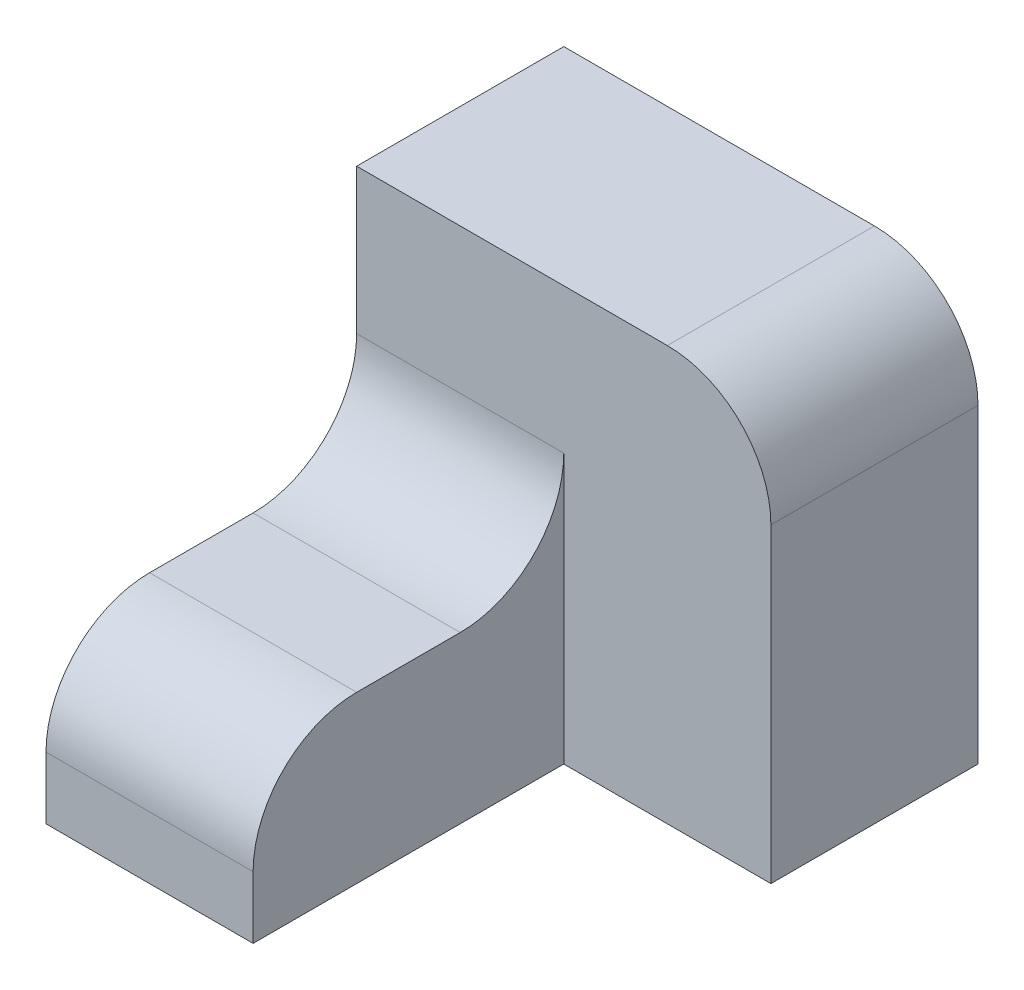
ISO-10303-21;
HEADER;
FILE_DESCRIPTION(('STEP AP214'),'2;1');
FILE_NAME('part.step','',(''),(''),'','','');
FILE_SCHEMA(('AUTOMOTIVE_DESIGN { 1 0 10303 214 1 1 1 1 }'));
ENDSEC;
DATA;
#1=APPLICATION_CONTEXT('core data for automotive mechanical design processes');
#2=APPLICATION_PROTOCOL_DEFINITION('international standard','automotive_design',2000,#1);
#3=PRODUCT_CONTEXT('',#1,'mechanical');
#4=PRODUCT('Part','Part','',(#3));
#5=PRODUCT_RELATED_PRODUCT_CATEGORY('part','',(#4));
#6=PRODUCT_DEFINITION_FORMATION('','',#4);
#7=PRODUCT_DEFINITION_CONTEXT('part definition',#1,'design');
#8=PRODUCT_DEFINITION('design','',#6,#7);
#9=PRODUCT_DEFINITION_SHAPE('','',#8);
#10=(LENGTH_UNIT() NAMED_UNIT(*) SI_UNIT(.MILLI.,.METRE.));
#11=(NAMED_UNIT(*) PLANE_ANGLE_UNIT() SI_UNIT($,.RADIAN.));
#12=(NAMED_UNIT(*) SI_UNIT($,.STERADIAN.) SOLID_ANGLE_UNIT());
#13=UNCERTAINTY_MEASURE_WITH_UNIT(LENGTH_MEASURE(1.E-05),#10,'distance_accuracy_value','');
#14=(GEOMETRIC_REPRESENTATION_CONTEXT(3) GLOBAL_UNCERTAINTY_ASSIGNED_CONTEXT((#13)) GLOBAL_UNIT_ASSIGNED_CONTEXT((#10,
#11,#12)) REPRESENTATION_CONTEXT('',''));
#15=CARTESIAN_POINT('',(0.,0.,0.));
#16=DIRECTION('',(0.,0.,1.));
#17=DIRECTION('',(1.,0.,0.));
#18=AXIS2_PLACEMENT_3D('',#15,#16,#17);
#19=CARTESIAN_POINT('',(-10.,0.,30.));
#20=DIRECTION('',(0.,-1.,0.));
#21=DIRECTION('',(1.,0.,0.));
#22=AXIS2_PLACEMENT_3D('',#19,#20,#21);
#23=PLANE('',#22);
#24=DIRECTION('',(0.,0.,-1.));
#25=VECTOR('',#24,1.);
#26=CARTESIAN_POINT('',(-10.,0.,30.));
#27=LINE('',#26,#25);
#28=CARTESIAN_POINT('',(-10.,0.,20.));
#29=VERTEX_POINT('',#28);
#30=CARTESIAN_POINT('',(-10.,0.,10.));
#31=VERTEX_POINT('',#30);
#32=EDGE_CURVE('E164',#29,#31,#27,.T.);
#33=ORIENTED_EDGE('',*,*,#32,.T.);
#34=DIRECTION('',(-1.,0.,0.));
#35=VECTOR('',#34,1.);
#36=CARTESIAN_POINT('',(-10.,0.,10.));
#37=LINE('',#36,#35);
#38=CARTESIAN_POINT('',(-30.,0.,10.));
#39=VERTEX_POINT('',#38);
#40=EDGE_CURVE('E178',#31,#39,#37,.T.);
#41=ORIENTED_EDGE('',*,*,#40,.T.);
#42=DIRECTION('',(0.,0.,-1.));
#43=VECTOR('',#42,1.);
#44=CARTESIAN_POINT('',(-30.,0.,30.));
#45=LINE('',#44,#43);
#46=CARTESIAN_POINT('',(-30.,0.,20.));
#47=VERTEX_POINT('',#46);
#48=EDGE_CURVE('E173',#47,#39,#45,.T.);
#49=ORIENTED_EDGE('',*,*,#48,.F.);
#50=DIRECTION('',(-1.,0.,0.));
#51=VECTOR('',#50,1.);
#52=CARTESIAN_POINT('',(-10.,0.,20.));
#53=LINE('',#52,#51);
#54=EDGE_CURVE('E176',#47,#29,#53,.F.);
#55=ORIENTED_EDGE('',*,*,#54,.T.);
#56=EDGE_LOOP('',(#33,#41,#49,#55));
#57=FACE_BOUND('',#56,.T.);
#58=ADVANCED_FACE('F35',(#57),#23,.F.);
#59=CARTESIAN_POINT('',(-30.,0.,30.));
#60=DIRECTION('',(1.,0.,0.));
#61=DIRECTION('',(0.,0.,-1.));
#62=AXIS2_PLACEMENT_3D('',#59,#60,#61);
#63=PLANE('',#62);
#64=DIRECTION('',(0.,-1.,0.));
#65=VECTOR('',#64,1.);
#66=CARTESIAN_POINT('',(-30.,0.,30.));
#67=LINE('',#66,#65);
#68=CARTESIAN_POINT('',(-30.,-10.,30.));
#69=VERTEX_POINT('',#68);
#70=CARTESIAN_POINT('',(-30.,-16.,30.));
#71=VERTEX_POINT('',#70);
#72=EDGE_CURVE('E158',#69,#71,#67,.T.);
#73=ORIENTED_EDGE('',*,*,#72,.F.);
#74=CARTESIAN_POINT('',(-30.,-10.,20.));
#75=DIRECTION('',(1.,0.,0.));
#76=DIRECTION('',(0.,0.,-1.));
#77=AXIS2_PLACEMENT_3D('',#74,#75,#76);
#78=CIRCLE('',#77,10.);
#79=EDGE_CURVE('E58',#69,#47,#78,.F.);
#80=ORIENTED_EDGE('',*,*,#79,.T.);
#81=ORIENTED_EDGE('',*,*,#48,.T.);
#82=CARTESIAN_POINT('',(-30.,10.,10.));
#83=DIRECTION('',(1.,0.,0.));
#84=DIRECTION('',(0.,0.,-1.));
#85=AXIS2_PLACEMENT_3D('',#82,#83,#84);
#86=CIRCLE('',#85,10.);
#87=CARTESIAN_POINT('',(-30.,10.,0.));
#88=VERTEX_POINT('',#87);
#89=EDGE_CURVE('E43',#39,#88,#86,.T.);
#90=ORIENTED_EDGE('',*,*,#89,.T.);
#91=DIRECTION('',(0.,-1.,0.));
#92=VECTOR('',#91,1.);
#93=CARTESIAN_POINT('',(-30.,24.,0.));
#94=LINE('',#93,#92);
#95=CARTESIAN_POINT('',(-30.,24.,0.));
#96=VERTEX_POINT('',#95);
#97=EDGE_CURVE('E134',#96,#88,#94,.T.);
#98=ORIENTED_EDGE('',*,*,#97,.F.);
#99=DIRECTION('',(0.,0.,1.));
#100=VECTOR('',#99,1.);
#101=CARTESIAN_POINT('',(-30.,24.,-20.));
#102=LINE('',#101,#100);
#103=CARTESIAN_POINT('',(-30.,24.,-20.));
#104=VERTEX_POINT('',#103);
#105=EDGE_CURVE('E118',#104,#96,#102,.T.);
#106=ORIENTED_EDGE('',*,*,#105,.F.);
#107=DIRECTION('',(0.,-1.,0.));
#108=VECTOR('',#107,1.);
#109=CARTESIAN_POINT('',(-30.,24.,-20.));
#110=LINE('',#109,#108);
#111=CARTESIAN_POINT('',(-30.,-16.,-20.));
#112=VERTEX_POINT('',#111);
#113=EDGE_CURVE('E125',#104,#112,#110,.T.);
#114=ORIENTED_EDGE('',*,*,#113,.T.);
#115=DIRECTION('',(0.,0.,-1.));
#116=VECTOR('',#115,1.);
#117=CARTESIAN_POINT('',(-30.,-16.,30.));
#118=LINE('',#117,#116);
#119=EDGE_CURVE('E171',#71,#112,#118,.T.);
#120=ORIENTED_EDGE('',*,*,#119,.F.);
#121=EDGE_LOOP('',(#73,#80,#81,#90,#98,#106,#114,#120));
#122=FACE_BOUND('',#121,.T.);
#123=ADVANCED_FACE('F131',(#122),#63,.F.);
#124=CARTESIAN_POINT('',(-30.,-16.,30.));
#125=DIRECTION('',(0.,1.,0.));
#126=DIRECTION('',(0.,0.,1.));
#127=AXIS2_PLACEMENT_3D('',#124,#125,#126);
#128=PLANE('',#127);
#129=ORIENTED_EDGE('',*,*,#119,.T.);
#130=DIRECTION('',(1.,0.,0.));
#131=VECTOR('',#130,1.);
#132=CARTESIAN_POINT('',(-30.,-16.,-20.));
#133=LINE('',#132,#131);
#134=CARTESIAN_POINT('',(10.,-16.,-20.));
#135=VERTEX_POINT('',#134);
#136=EDGE_CURVE('E142',#112,#135,#133,.T.);
#137=ORIENTED_EDGE('',*,*,#136,.T.);
#138=DIRECTION('',(0.,0.,1.));
#139=VECTOR('',#138,1.);
#140=CARTESIAN_POINT('',(10.,-16.,-20.));
#141=LINE('',#140,#139);
#142=CARTESIAN_POINT('',(10.,-16.,0.));
#143=VERTEX_POINT('',#142);
#144=EDGE_CURVE('E135',#135,#143,#141,.T.);
#145=ORIENTED_EDGE('',*,*,#144,.T.);
#146=DIRECTION('',(1.,0.,0.));
#147=VECTOR('',#146,1.);
#148=CARTESIAN_POINT('',(-30.,-16.,0.));
#149=LINE('',#148,#147);
#150=CARTESIAN_POINT('',(-10.,-16.,0.));
#151=VERTEX_POINT('',#150);
#152=EDGE_CURVE('E151',#151,#143,#149,.T.);
#153=ORIENTED_EDGE('',*,*,#152,.F.);
#154=DIRECTION('',(0.,0.,-1.));
#155=VECTOR('',#154,1.);
#156=CARTESIAN_POINT('',(-10.,-16.,30.));
#157=LINE('',#156,#155);
#158=CARTESIAN_POINT('',(-10.,-16.,30.));
#159=VERTEX_POINT('',#158);
#160=EDGE_CURVE('E168',#159,#151,#157,.T.);
#161=ORIENTED_EDGE('',*,*,#160,.F.);
#162=DIRECTION('',(1.,0.,0.));
#163=VECTOR('',#162,1.);
#164=CARTESIAN_POINT('',(-30.,-16.,30.));
#165=LINE('',#164,#163);
#166=EDGE_CURVE('E160',#71,#159,#165,.T.);
#167=ORIENTED_EDGE('',*,*,#166,.F.);
#168=EDGE_LOOP('',(#129,#137,#145,#153,#161,#167));
#169=FACE_BOUND('',#168,.T.);
#170=ADVANCED_FACE('F210',(#169),#128,.F.);
#171=CARTESIAN_POINT('',(-10.,-16.,30.));
#172=DIRECTION('',(-1.,0.,0.));
#173=DIRECTION('',(0.,0.,1.));
#174=AXIS2_PLACEMENT_3D('',#171,#172,#173);
#175=PLANE('',#174);
#176=ORIENTED_EDGE('',*,*,#32,.F.);
#177=CARTESIAN_POINT('',(-10.,-10.,20.));
#178=DIRECTION('',(-1.,0.,0.));
#179=DIRECTION('',(0.,0.,1.));
#180=AXIS2_PLACEMENT_3D('',#177,#178,#179);
#181=CIRCLE('',#180,10.);
#182=CARTESIAN_POINT('',(-10.,-10.,30.));
#183=VERTEX_POINT('',#182);
#184=EDGE_CURVE('E50',#29,#183,#181,.F.);
#185=ORIENTED_EDGE('',*,*,#184,.T.);
#186=DIRECTION('',(0.,1.,0.));
#187=VECTOR('',#186,1.);
#188=CARTESIAN_POINT('',(-10.,-16.,30.));
#189=LINE('',#188,#187);
#190=EDGE_CURVE('E162',#159,#183,#189,.T.);
#191=ORIENTED_EDGE('',*,*,#190,.F.);
#192=ORIENTED_EDGE('',*,*,#160,.T.);
#193=DIRECTION('',(0.,1.,0.));
#194=VECTOR('',#193,1.);
#195=CARTESIAN_POINT('',(-10.,-16.,0.));
#196=LINE('',#195,#194);
#197=CARTESIAN_POINT('',(-10.,10.,0.));
#198=VERTEX_POINT('',#197);
#199=EDGE_CURVE('E156',#151,#198,#196,.T.);
#200=ORIENTED_EDGE('',*,*,#199,.T.);
#201=CARTESIAN_POINT('',(-10.,10.,10.));
#202=DIRECTION('',(-1.,0.,0.));
#203=DIRECTION('',(0.,0.,1.));
#204=AXIS2_PLACEMENT_3D('',#201,#202,#203);
#205=CIRCLE('',#204,10.);
#206=EDGE_CURVE('E11',#198,#31,#205,.T.);
#207=ORIENTED_EDGE('',*,*,#206,.T.);
#208=EDGE_LOOP('',(#176,#185,#191,#192,#200,#207));
#209=FACE_BOUND('',#208,.T.);
#210=ADVANCED_FACE('F203',(#209),#175,.F.);
#211=CARTESIAN_POINT('',(0.,0.,30.));
#212=DIRECTION('',(0.,0.,1.));
#213=DIRECTION('',(1.,0.,0.));
#214=AXIS2_PLACEMENT_3D('',#211,#212,#213);
#215=PLANE('',#214);
#216=ORIENTED_EDGE('',*,*,#190,.T.);
#217=DIRECTION('',(-1.,0.,0.));
#218=VECTOR('',#217,1.);
#219=CARTESIAN_POINT('',(-30.,-10.,30.));
#220=LINE('',#219,#218);
#221=EDGE_CURVE('E192',#183,#69,#220,.T.);
#222=ORIENTED_EDGE('',*,*,#221,.T.);
#223=ORIENTED_EDGE('',*,*,#72,.T.);
#224=ORIENTED_EDGE('',*,*,#166,.T.);
#225=EDGE_LOOP('',(#216,#222,#223,#224));
#226=FACE_BOUND('',#225,.T.);
#227=ADVANCED_FACE('F206',(#226),#215,.T.);
#228=CARTESIAN_POINT('',(0.,0.,0.));
#229=DIRECTION('',(0.,0.,1.));
#230=DIRECTION('',(1.,0.,0.));
#231=AXIS2_PLACEMENT_3D('',#228,#229,#230);
#232=PLANE('',#231);
#233=ORIENTED_EDGE('',*,*,#97,.T.);
#234=DIRECTION('',(-1.,0.,0.));
#235=VECTOR('',#234,1.);
#236=CARTESIAN_POINT('',(0.,10.,0.));
#237=LINE('',#236,#235);
#238=EDGE_CURVE('E183',#88,#198,#237,.F.);
#239=ORIENTED_EDGE('',*,*,#238,.T.);
#240=ORIENTED_EDGE('',*,*,#199,.F.);
#241=ORIENTED_EDGE('',*,*,#152,.T.);
#242=DIRECTION('',(0.,1.,0.));
#243=VECTOR('',#242,1.);
#244=CARTESIAN_POINT('',(10.,-16.,0.));
#245=LINE('',#244,#243);
#246=CARTESIAN_POINT('',(10.,14.,0.));
#247=VERTEX_POINT('',#246);
#248=EDGE_CURVE('E126',#143,#247,#245,.T.);
#249=ORIENTED_EDGE('',*,*,#248,.T.);
#250=CARTESIAN_POINT('',(0.,14.,0.));
#251=DIRECTION('',(0.,0.,1.));
#252=DIRECTION('',(1.,0.,0.));
#253=AXIS2_PLACEMENT_3D('',#250,#251,#252);
#254=CIRCLE('',#253,10.);
#255=CARTESIAN_POINT('',(0.,24.,0.));
#256=VERTEX_POINT('',#255);
#257=EDGE_CURVE('E181',#247,#256,#254,.T.);
#258=ORIENTED_EDGE('',*,*,#257,.T.);
#259=DIRECTION('',(-1.,0.,0.));
#260=VECTOR('',#259,1.);
#261=CARTESIAN_POINT('',(10.,24.,0.));
#262=LINE('',#261,#260);
#263=EDGE_CURVE('E148',#256,#96,#262,.T.);
#264=ORIENTED_EDGE('',*,*,#263,.T.);
#265=EDGE_LOOP('',(#233,#239,#240,#241,#249,#258,#264));
#266=FACE_BOUND('',#265,.T.);
#267=ADVANCED_FACE('F200',(#266),#232,.T.);
#268=CARTESIAN_POINT('',(10.,24.,-20.));
#269=DIRECTION('',(0.,1.,0.));
#270=DIRECTION('',(0.,0.,1.));
#271=AXIS2_PLACEMENT_3D('',#268,#269,#270);
#272=PLANE('',#271);
#273=ORIENTED_EDGE('',*,*,#263,.F.);
#274=DIRECTION('',(0.,0.,1.));
#275=VECTOR('',#274,1.);
#276=CARTESIAN_POINT('',(0.,24.,-20.));
#277=LINE('',#276,#275);
#278=CARTESIAN_POINT('',(0.,24.,-20.));
#279=VERTEX_POINT('',#278);
#280=EDGE_CURVE('E121',#256,#279,#277,.F.);
#281=ORIENTED_EDGE('',*,*,#280,.T.);
#282=DIRECTION('',(-1.,0.,0.));
#283=VECTOR('',#282,1.);
#284=CARTESIAN_POINT('',(10.,24.,-20.));
#285=LINE('',#284,#283);
#286=EDGE_CURVE('E114',#279,#104,#285,.T.);
#287=ORIENTED_EDGE('',*,*,#286,.T.);
#288=ORIENTED_EDGE('',*,*,#105,.T.);
#289=EDGE_LOOP('',(#273,#281,#287,#288));
#290=FACE_BOUND('',#289,.T.);
#291=ADVANCED_FACE('F117',(#290),#272,.T.);
#292=CARTESIAN_POINT('',(10.,-16.,-20.));
#293=DIRECTION('',(1.,0.,0.));
#294=DIRECTION('',(0.,0.,-1.));
#295=AXIS2_PLACEMENT_3D('',#292,#293,#294);
#296=PLANE('',#295);
#297=DIRECTION('',(0.,1.,0.));
#298=VECTOR('',#297,1.);
#299=CARTESIAN_POINT('',(10.,-16.,-20.));
#300=LINE('',#299,#298);
#301=CARTESIAN_POINT('',(10.,14.,-20.));
#302=VERTEX_POINT('',#301);
#303=EDGE_CURVE('E136',#135,#302,#300,.T.);
#304=ORIENTED_EDGE('',*,*,#303,.T.);
#305=DIRECTION('',(0.,0.,1.));
#306=VECTOR('',#305,1.);
#307=CARTESIAN_POINT('',(10.,14.,-20.));
#308=LINE('',#307,#306);
#309=EDGE_CURVE('E186',#302,#247,#308,.T.);
#310=ORIENTED_EDGE('',*,*,#309,.T.);
#311=ORIENTED_EDGE('',*,*,#248,.F.);
#312=ORIENTED_EDGE('',*,*,#144,.F.);
#313=EDGE_LOOP('',(#304,#310,#311,#312));
#314=FACE_BOUND('',#313,.T.);
#315=ADVANCED_FACE('F214',(#314),#296,.T.);
#316=CARTESIAN_POINT('',(0.,0.,-20.));
#317=DIRECTION('',(0.,0.,1.));
#318=DIRECTION('',(1.,0.,0.));
#319=AXIS2_PLACEMENT_3D('',#316,#317,#318);
#320=PLANE('',#319);
#321=ORIENTED_EDGE('',*,*,#286,.F.);
#322=CARTESIAN_POINT('',(0.,14.,-20.));
#323=DIRECTION('',(0.,0.,1.));
#324=DIRECTION('',(1.,0.,0.));
#325=AXIS2_PLACEMENT_3D('',#322,#323,#324);
#326=CIRCLE('',#325,10.);
#327=EDGE_CURVE('E190',#279,#302,#326,.F.);
#328=ORIENTED_EDGE('',*,*,#327,.T.);
#329=ORIENTED_EDGE('',*,*,#303,.F.);
#330=ORIENTED_EDGE('',*,*,#136,.F.);
#331=ORIENTED_EDGE('',*,*,#113,.F.);
#332=EDGE_LOOP('',(#321,#328,#329,#330,#331));
#333=FACE_BOUND('',#332,.T.);
#334=ADVANCED_FACE('F139',(#333),#320,.F.);
#335=CARTESIAN_POINT('',(-10.,10.,10.));
#336=DIRECTION('',(-1.,0.,0.));
#337=DIRECTION('',(0.,-1.,0.));
#338=AXIS2_PLACEMENT_3D('',#335,#336,#337);
#339=CYLINDRICAL_SURFACE('',#338,10.);
#340=ORIENTED_EDGE('',*,*,#206,.F.);
#341=ORIENTED_EDGE('',*,*,#238,.F.);
#342=ORIENTED_EDGE('',*,*,#89,.F.);
#343=ORIENTED_EDGE('',*,*,#40,.F.);
#344=EDGE_LOOP('',(#340,#341,#342,#343));
#345=FACE_BOUND('',#344,.T.);
#346=ADVANCED_FACE('F202',(#345),#339,.F.);
#347=CARTESIAN_POINT('',(0.,14.,-20.));
#348=DIRECTION('',(0.,0.,1.));
#349=DIRECTION('',(1.,0.,0.));
#350=AXIS2_PLACEMENT_3D('',#347,#348,#349);
#351=CYLINDRICAL_SURFACE('',#350,10.);
#352=ORIENTED_EDGE('',*,*,#327,.F.);
#353=ORIENTED_EDGE('',*,*,#280,.F.);
#354=ORIENTED_EDGE('',*,*,#257,.F.);
#355=ORIENTED_EDGE('',*,*,#309,.F.);
#356=EDGE_LOOP('',(#352,#353,#354,#355));
#357=FACE_BOUND('',#356,.T.);
#358=ADVANCED_FACE('F217',(#357),#351,.T.);
#359=CARTESIAN_POINT('',(0.,-10.,20.));
#360=DIRECTION('',(1.,0.,0.));
#361=DIRECTION('',(0.,1.,0.));
#362=AXIS2_PLACEMENT_3D('',#359,#360,#361);
#363=CYLINDRICAL_SURFACE('',#362,10.);
#364=ORIENTED_EDGE('',*,*,#184,.F.);
#365=ORIENTED_EDGE('',*,*,#54,.F.);
#366=ORIENTED_EDGE('',*,*,#79,.F.);
#367=ORIENTED_EDGE('',*,*,#221,.F.);
#368=EDGE_LOOP('',(#364,#365,#366,#367));
#369=FACE_BOUND('',#368,.T.);
#370=ADVANCED_FACE('F37',(#369),#363,.T.);
#371=CLOSED_SHELL('',(#58,#123,#170,#210,#227,#267,#291,#315,#334,#346,#358,#370));
#372=MANIFOLD_SOLID_BREP('B2',#371);
#373=ADVANCED_BREP_SHAPE_REPRESENTATION('',(#18,#372),#14);
#374=SHAPE_DEFINITION_REPRESENTATION(#9,#373);
ENDSEC;
END-ISO-10303-21;
